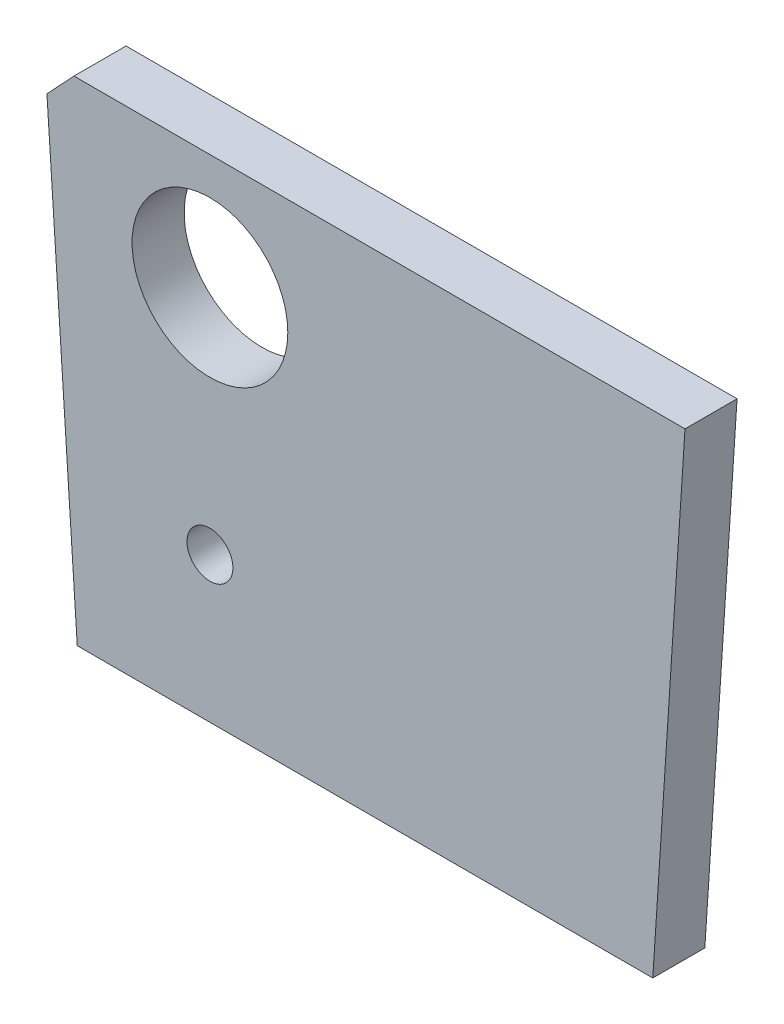
ISO-10303-21;
HEADER;
FILE_DESCRIPTION(('STEP AP214'),'2;1');
FILE_NAME('part.step','',(''),(''),'','','');
FILE_SCHEMA(('AUTOMOTIVE_DESIGN { 1 0 10303 214 1 1 1 1 }'));
ENDSEC;
DATA;
#1=APPLICATION_CONTEXT('core data for automotive mechanical design processes');
#2=APPLICATION_PROTOCOL_DEFINITION('international standard','automotive_design',2000,#1);
#3=PRODUCT_CONTEXT('',#1,'mechanical');
#4=PRODUCT('Part','Part','',(#3));
#5=PRODUCT_RELATED_PRODUCT_CATEGORY('part','',(#4));
#6=PRODUCT_DEFINITION_FORMATION('','',#4);
#7=PRODUCT_DEFINITION_CONTEXT('part definition',#1,'design');
#8=PRODUCT_DEFINITION('design','',#6,#7);
#9=PRODUCT_DEFINITION_SHAPE('','',#8);
#10=(LENGTH_UNIT() NAMED_UNIT(*) SI_UNIT(.MILLI.,.METRE.));
#11=(NAMED_UNIT(*) PLANE_ANGLE_UNIT() SI_UNIT($,.RADIAN.));
#12=(NAMED_UNIT(*) SI_UNIT($,.STERADIAN.) SOLID_ANGLE_UNIT());
#13=UNCERTAINTY_MEASURE_WITH_UNIT(LENGTH_MEASURE(1.E-05),#10,'distance_accuracy_value','');
#14=(GEOMETRIC_REPRESENTATION_CONTEXT(3) GLOBAL_UNCERTAINTY_ASSIGNED_CONTEXT((#13)) GLOBAL_UNIT_ASSIGNED_CONTEXT((#10,
#11,#12)) REPRESENTATION_CONTEXT('',''));
#15=CARTESIAN_POINT('',(0.,0.,0.));
#16=DIRECTION('',(0.,0.,1.));
#17=DIRECTION('',(1.,0.,0.));
#18=AXIS2_PLACEMENT_3D('',#15,#16,#17);
#19=CARTESIAN_POINT('',(0.81962306,34.9904017987721,0.899999999999996));
#20=DIRECTION('',(0.,0.,-1.));
#21=DIRECTION('',(-1.,0.,0.));
#22=AXIS2_PLACEMENT_3D('',#19,#20,#21);
#23=PLANE('',#22);
#24=DIRECTION('',(-1.,0.,0.));
#25=VECTOR('',#24,1.);
#26=CARTESIAN_POINT('',(-2.15888610624072,43.4904017987721,0.899999999999995));
#27=LINE('',#26,#25);
#28=CARTESIAN_POINT('',(8.21261996892953,43.4904017987721,0.899999999999998));
#29=VERTEX_POINT('',#28);
#30=CARTESIAN_POINT('',(-2.35051153311789,43.4904017987722,0.899999999999995));
#31=VERTEX_POINT('',#30);
#32=EDGE_CURVE('E108',#29,#31,#27,.T.);
#33=ORIENTED_EDGE('',*,*,#32,.T.);
#34=DIRECTION('',(0.683592302022868,0.729864072697839,0.));
#35=VECTOR('',#34,1.);
#36=CARTESIAN_POINT('',(-2.81780996850282,42.9914723371528,0.899999999999995));
#37=LINE('',#36,#35);
#38=CARTESIAN_POINT('',(-2.81780996850282,42.9914723371528,0.899999999999995));
#39=VERTEX_POINT('',#38);
#40=EDGE_CURVE('E11',#31,#39,#37,.F.);
#41=ORIENTED_EDGE('',*,*,#40,.T.);
#42=DIRECTION('',(0.0654031292301501,-0.997858923238604,0.));
#43=VECTOR('',#42,1.);
#44=CARTESIAN_POINT('',(-2.29339209918831,34.9904017987721,0.899999999999998));
#45=LINE('',#44,#43);
#46=CARTESIAN_POINT('',(-2.29339209918831,34.9904017987721,0.899999999999998));
#47=VERTEX_POINT('',#46);
#48=EDGE_CURVE('E83',#39,#47,#45,.T.);
#49=ORIENTED_EDGE('',*,*,#48,.T.);
#50=DIRECTION('',(1.,0.,0.));
#51=VECTOR('',#50,1.);
#52=CARTESIAN_POINT('',(-0.819623060000005,34.9904017987721,0.899999999999998));
#53=LINE('',#52,#51);
#54=CARTESIAN_POINT('',(7.655500535,34.9904017987721,0.899999999999998));
#55=VERTEX_POINT('',#54);
#56=EDGE_CURVE('E88',#47,#55,#53,.T.);
#57=ORIENTED_EDGE('',*,*,#56,.T.);
#58=DIRECTION('',(-0.0654031292301434,-0.997858923238604,0.));
#59=VECTOR('',#58,1.);
#60=CARTESIAN_POINT('',(8.21261996892953,43.4904017987721,0.899999999999998));
#61=LINE('',#60,#59);
#62=EDGE_CURVE('E101',#29,#55,#61,.T.);
#63=ORIENTED_EDGE('',*,*,#62,.F.);
#64=EDGE_LOOP('',(#33,#41,#49,#57,#63));
#65=FACE_BOUND('',#64,.T.);
#66=CARTESIAN_POINT('',(0.,37.5,0.899999999999998));
#67=DIRECTION('',(0.,0.,1.));
#68=DIRECTION('',(1.,0.,0.));
#69=AXIS2_PLACEMENT_3D('',#66,#67,#68);
#70=CIRCLE('',#69,0.396875);
#71=CARTESIAN_POINT('',(0.396874999999999,37.5,0.899999999999998));
#72=VERTEX_POINT('',#71);
#73=EDGE_CURVE('E117',#72,#72,#70,.T.);
#74=ORIENTED_EDGE('',*,*,#73,.F.);
#75=EDGE_LOOP('',(#74));
#76=FACE_BOUND('',#75,.T.);
#77=CARTESIAN_POINT('',(0.,41.5,0.899999999999998));
#78=DIRECTION('',(0.,0.,1.));
#79=DIRECTION('',(1.,0.,0.));
#80=AXIS2_PLACEMENT_3D('',#77,#78,#79);
#81=CIRCLE('',#80,1.3462);
#82=CARTESIAN_POINT('',(1.3462,41.5,0.899999999999998));
#83=VERTEX_POINT('',#82);
#84=EDGE_CURVE('E133',#83,#83,#81,.T.);
#85=ORIENTED_EDGE('',*,*,#84,.F.);
#86=EDGE_LOOP('',(#85));
#87=FACE_BOUND('',#86,.T.);
#88=ADVANCED_FACE('F39',(#65,#76,#87),#23,.F.);
#89=CARTESIAN_POINT('',(0.81962306,34.9904017987721,0.));
#90=DIRECTION('',(0.,0.,-1.));
#91=DIRECTION('',(-1.,0.,0.));
#92=AXIS2_PLACEMENT_3D('',#89,#90,#91);
#93=PLANE('',#92);
#94=DIRECTION('',(0.0654031292301501,-0.997858923238604,0.));
#95=VECTOR('',#94,1.);
#96=CARTESIAN_POINT('',(-2.29339209918831,34.9904017987721,0.));
#97=LINE('',#96,#95);
#98=CARTESIAN_POINT('',(-2.81780996850282,42.9914723371528,0.));
#99=VERTEX_POINT('',#98);
#100=CARTESIAN_POINT('',(-2.29339209918831,34.9904017987721,0.));
#101=VERTEX_POINT('',#100);
#102=EDGE_CURVE('E95',#99,#101,#97,.T.);
#103=ORIENTED_EDGE('',*,*,#102,.F.);
#104=DIRECTION('',(-0.683592302022868,-0.729864072697839,0.));
#105=VECTOR('',#104,1.);
#106=CARTESIAN_POINT('',(-5.11001302155835,40.544112045349,0.));
#107=LINE('',#106,#105);
#108=CARTESIAN_POINT('',(-2.35051153311789,43.4904017987722,0.));
#109=VERTEX_POINT('',#108);
#110=EDGE_CURVE('E61',#99,#109,#107,.F.);
#111=ORIENTED_EDGE('',*,*,#110,.T.);
#112=DIRECTION('',(-1.,0.,0.));
#113=VECTOR('',#112,1.);
#114=CARTESIAN_POINT('',(-2.15888610624072,43.4904017987721,0.));
#115=LINE('',#114,#113);
#116=CARTESIAN_POINT('',(8.21261996892953,43.4904017987721,0.));
#117=VERTEX_POINT('',#116);
#118=EDGE_CURVE('E115',#117,#109,#115,.T.);
#119=ORIENTED_EDGE('',*,*,#118,.F.);
#120=DIRECTION('',(-0.0654031292301434,-0.997858923238604,0.));
#121=VECTOR('',#120,1.);
#122=CARTESIAN_POINT('',(8.21261996892953,43.4904017987721,0.));
#123=LINE('',#122,#121);
#124=CARTESIAN_POINT('',(7.655500535,34.9904017987721,0.));
#125=VERTEX_POINT('',#124);
#126=EDGE_CURVE('E121',#117,#125,#123,.T.);
#127=ORIENTED_EDGE('',*,*,#126,.T.);
#128=DIRECTION('',(1.,0.,0.));
#129=VECTOR('',#128,1.);
#130=CARTESIAN_POINT('',(-0.819623060000005,34.9904017987721,0.));
#131=LINE('',#130,#129);
#132=EDGE_CURVE('E111',#101,#125,#131,.T.);
#133=ORIENTED_EDGE('',*,*,#132,.F.);
#134=EDGE_LOOP('',(#103,#111,#119,#127,#133));
#135=FACE_BOUND('',#134,.T.);
#136=CARTESIAN_POINT('',(0.,37.5,0.));
#137=DIRECTION('',(0.,0.,1.));
#138=DIRECTION('',(1.,0.,0.));
#139=AXIS2_PLACEMENT_3D('',#136,#137,#138);
#140=CIRCLE('',#139,0.396875);
#141=CARTESIAN_POINT('',(0.396874999999999,37.5,0.));
#142=VERTEX_POINT('',#141);
#143=EDGE_CURVE('E139',#142,#142,#140,.T.);
#144=ORIENTED_EDGE('',*,*,#143,.T.);
#145=EDGE_LOOP('',(#144));
#146=FACE_BOUND('',#145,.T.);
#147=CARTESIAN_POINT('',(0.,41.5,0.));
#148=DIRECTION('',(0.,0.,1.));
#149=DIRECTION('',(1.,0.,0.));
#150=AXIS2_PLACEMENT_3D('',#147,#148,#149);
#151=CIRCLE('',#150,1.3462);
#152=CARTESIAN_POINT('',(1.3462,41.5,0.));
#153=VERTEX_POINT('',#152);
#154=EDGE_CURVE('E130',#153,#153,#151,.T.);
#155=ORIENTED_EDGE('',*,*,#154,.T.);
#156=EDGE_LOOP('',(#155));
#157=FACE_BOUND('',#156,.T.);
#158=ADVANCED_FACE('F122',(#135,#146,#157),#93,.T.);
#159=CARTESIAN_POINT('',(-2.15888610624072,43.4904017987721,0.899999999999995));
#160=DIRECTION('',(0.,-1.,0.));
#161=DIRECTION('',(0.,0.,-1.));
#162=AXIS2_PLACEMENT_3D('',#159,#160,#161);
#163=PLANE('',#162);
#164=ORIENTED_EDGE('',*,*,#118,.T.);
#165=DIRECTION('',(0.,0.,1.));
#166=VECTOR('',#165,1.);
#167=CARTESIAN_POINT('',(-2.35051153311789,43.4904017987722,0.899999999999995));
#168=LINE('',#167,#166);
#169=EDGE_CURVE('E47',#109,#31,#168,.T.);
#170=ORIENTED_EDGE('',*,*,#169,.T.);
#171=ORIENTED_EDGE('',*,*,#32,.F.);
#172=DIRECTION('',(0.,0.,1.));
#173=VECTOR('',#172,1.);
#174=CARTESIAN_POINT('',(8.21261996892953,43.4904017987721,0.));
#175=LINE('',#174,#173);
#176=EDGE_CURVE('E127',#117,#29,#175,.T.);
#177=ORIENTED_EDGE('',*,*,#176,.F.);
#178=EDGE_LOOP('',(#164,#170,#171,#177));
#179=FACE_BOUND('',#178,.T.);
#180=ADVANCED_FACE('F157',(#179),#163,.F.);
#181=CARTESIAN_POINT('',(-0.819623060000005,34.9904017987721,0.899999999999998));
#182=DIRECTION('',(0.,1.,0.));
#183=DIRECTION('',(0.,0.,1.));
#184=AXIS2_PLACEMENT_3D('',#181,#182,#183);
#185=PLANE('',#184);
#186=ORIENTED_EDGE('',*,*,#56,.F.);
#187=DIRECTION('',(0.,0.,-1.));
#188=VECTOR('',#187,1.);
#189=CARTESIAN_POINT('',(-2.29339209918831,34.9904017987721,0.899999999999998));
#190=LINE('',#189,#188);
#191=EDGE_CURVE('E94',#47,#101,#190,.T.);
#192=ORIENTED_EDGE('',*,*,#191,.T.);
#193=ORIENTED_EDGE('',*,*,#132,.T.);
#194=DIRECTION('',(0.,0.,1.));
#195=VECTOR('',#194,1.);
#196=CARTESIAN_POINT('',(7.655500535,34.9904017987721,0.));
#197=LINE('',#196,#195);
#198=EDGE_CURVE('E105',#125,#55,#197,.T.);
#199=ORIENTED_EDGE('',*,*,#198,.T.);
#200=EDGE_LOOP('',(#186,#192,#193,#199));
#201=FACE_BOUND('',#200,.T.);
#202=ADVANCED_FACE('F103',(#201),#185,.F.);
#203=CARTESIAN_POINT('',(0.,37.5,0.899999999999998));
#204=DIRECTION('',(0.,0.,-1.));
#205=DIRECTION('',(-1.,0.,0.));
#206=AXIS2_PLACEMENT_3D('',#203,#204,#205);
#207=CYLINDRICAL_SURFACE('',#206,0.396875);
#208=ORIENTED_EDGE('',*,*,#73,.T.);
#209=EDGE_LOOP('',(#208));
#210=FACE_BOUND('',#209,.T.);
#211=ORIENTED_EDGE('',*,*,#143,.F.);
#212=EDGE_LOOP('',(#211));
#213=FACE_BOUND('',#212,.T.);
#214=ADVANCED_FACE('F146',(#210,#213),#207,.F.);
#215=CARTESIAN_POINT('',(0.,41.5,0.899999999999998));
#216=DIRECTION('',(0.,0.,-1.));
#217=DIRECTION('',(-1.,0.,0.));
#218=AXIS2_PLACEMENT_3D('',#215,#216,#217);
#219=CYLINDRICAL_SURFACE('',#218,1.3462);
#220=ORIENTED_EDGE('',*,*,#84,.T.);
#221=EDGE_LOOP('',(#220));
#222=FACE_BOUND('',#221,.T.);
#223=ORIENTED_EDGE('',*,*,#154,.F.);
#224=EDGE_LOOP('',(#223));
#225=FACE_BOUND('',#224,.T.);
#226=ADVANCED_FACE('F148',(#222,#225),#219,.F.);
#227=CARTESIAN_POINT('',(8.21261996892953,43.4904017987721,0.));
#228=DIRECTION('',(-0.997858923238604,0.0654031292301437,0.));
#229=DIRECTION('',(-0.0654031292301434,-0.997858923238604,0.));
#230=AXIS2_PLACEMENT_3D('',#227,#228,#229);
#231=PLANE('',#230);
#232=ORIENTED_EDGE('',*,*,#62,.T.);
#233=ORIENTED_EDGE('',*,*,#198,.F.);
#234=ORIENTED_EDGE('',*,*,#126,.F.);
#235=ORIENTED_EDGE('',*,*,#176,.T.);
#236=EDGE_LOOP('',(#232,#233,#234,#235));
#237=FACE_BOUND('',#236,.T.);
#238=ADVANCED_FACE('F129',(#237),#231,.F.);
#239=CARTESIAN_POINT('',(-2.29339209918831,34.9904017987721,0.899999999999998));
#240=DIRECTION('',(0.997858923238604,0.0654031292301497,0.));
#241=DIRECTION('',(-0.0654031292301501,0.997858923238604,0.));
#242=AXIS2_PLACEMENT_3D('',#239,#240,#241);
#243=PLANE('',#242);
#244=ORIENTED_EDGE('',*,*,#48,.F.);
#245=DIRECTION('',(0.,0.,-1.));
#246=VECTOR('',#245,1.);
#247=CARTESIAN_POINT('',(-2.81780996850282,42.9914723371528,0.899999999999995));
#248=LINE('',#247,#246);
#249=EDGE_CURVE('E107',#39,#99,#248,.T.);
#250=ORIENTED_EDGE('',*,*,#249,.T.);
#251=ORIENTED_EDGE('',*,*,#102,.T.);
#252=ORIENTED_EDGE('',*,*,#191,.F.);
#253=EDGE_LOOP('',(#244,#250,#251,#252));
#254=FACE_BOUND('',#253,.T.);
#255=ADVANCED_FACE('F98',(#254),#243,.F.);
#256=CARTESIAN_POINT('',(-2.81780996850282,42.9914723371528,0.899999999999995));
#257=DIRECTION('',(0.72986407269784,-0.683592302022868,0.));
#258=DIRECTION('',(0.683592302022868,0.729864072697839,0.));
#259=AXIS2_PLACEMENT_3D('',#256,#257,#258);
#260=PLANE('',#259);
#261=ORIENTED_EDGE('',*,*,#40,.F.);
#262=ORIENTED_EDGE('',*,*,#169,.F.);
#263=ORIENTED_EDGE('',*,*,#110,.F.);
#264=ORIENTED_EDGE('',*,*,#249,.F.);
#265=EDGE_LOOP('',(#261,#262,#263,#264));
#266=FACE_BOUND('',#265,.T.);
#267=ADVANCED_FACE('F41',(#266),#260,.F.);
#268=CLOSED_SHELL('',(#88,#158,#180,#202,#214,#226,#238,#255,#267));
#269=MANIFOLD_SOLID_BREP('B2',#268);
#270=ADVANCED_BREP_SHAPE_REPRESENTATION('',(#18,#269),#14);
#271=SHAPE_DEFINITION_REPRESENTATION(#9,#270);
ENDSEC;
END-ISO-10303-21;
